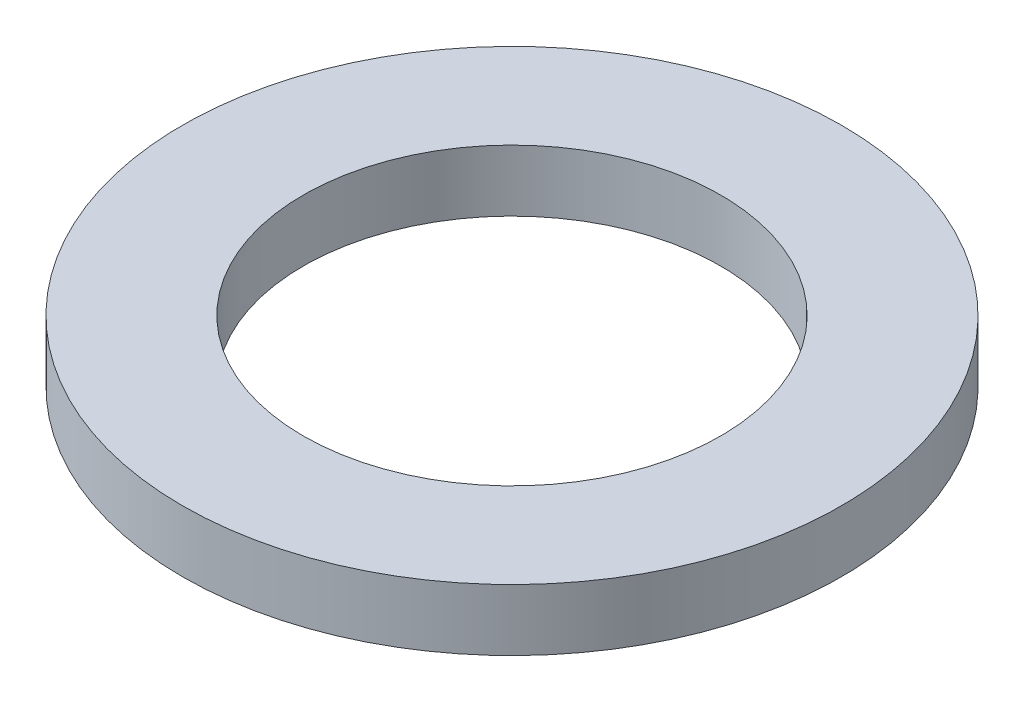
ISO-10303-21;
HEADER;
FILE_DESCRIPTION(('STEP AP214'),'2;1');
FILE_NAME('part.step','',(''),(''),'','','');
FILE_SCHEMA(('AUTOMOTIVE_DESIGN { 1 0 10303 214 1 1 1 1 }'));
ENDSEC;
DATA;
#1=APPLICATION_CONTEXT('core data for automotive mechanical design processes');
#2=APPLICATION_PROTOCOL_DEFINITION('international standard','automotive_design',2000,#1);
#3=PRODUCT_CONTEXT('',#1,'mechanical');
#4=PRODUCT('Part','Part','',(#3));
#5=PRODUCT_RELATED_PRODUCT_CATEGORY('part','',(#4));
#6=PRODUCT_DEFINITION_FORMATION('','',#4);
#7=PRODUCT_DEFINITION_CONTEXT('part definition',#1,'design');
#8=PRODUCT_DEFINITION('design','',#6,#7);
#9=PRODUCT_DEFINITION_SHAPE('','',#8);
#10=(LENGTH_UNIT() NAMED_UNIT(*) SI_UNIT(.MILLI.,.METRE.));
#11=(NAMED_UNIT(*) PLANE_ANGLE_UNIT() SI_UNIT($,.RADIAN.));
#12=(NAMED_UNIT(*) SI_UNIT($,.STERADIAN.) SOLID_ANGLE_UNIT());
#13=UNCERTAINTY_MEASURE_WITH_UNIT(LENGTH_MEASURE(1.E-05),#10,'distance_accuracy_value','');
#14=(GEOMETRIC_REPRESENTATION_CONTEXT(3) GLOBAL_UNCERTAINTY_ASSIGNED_CONTEXT((#13)) GLOBAL_UNIT_ASSIGNED_CONTEXT((#10,
#11,#12)) REPRESENTATION_CONTEXT('',''));
#15=CARTESIAN_POINT('',(0.,0.,0.));
#16=DIRECTION('',(0.,0.,1.));
#17=DIRECTION('',(1.,0.,0.));
#18=AXIS2_PLACEMENT_3D('',#15,#16,#17);
#19=CARTESIAN_POINT('',(0.,14.,0.));
#20=DIRECTION('',(0.,-1.,0.));
#21=DIRECTION('',(0.,0.,-1.));
#22=AXIS2_PLACEMENT_3D('',#19,#20,#21);
#23=CYLINDRICAL_SURFACE('',#22,75.);
#24=CARTESIAN_POINT('',(0.,14.,0.));
#25=DIRECTION('',(0.,1.,0.));
#26=DIRECTION('',(0.,0.,1.));
#27=AXIS2_PLACEMENT_3D('',#24,#25,#26);
#28=CIRCLE('',#27,75.);
#29=CARTESIAN_POINT('',(0.,14.,75.));
#30=VERTEX_POINT('',#29);
#31=EDGE_CURVE('E10',#30,#30,#28,.T.);
#32=ORIENTED_EDGE('',*,*,#31,.F.);
#33=EDGE_LOOP('',(#32));
#34=FACE_BOUND('',#33,.T.);
#35=CARTESIAN_POINT('',(0.,0.,0.));
#36=DIRECTION('',(0.,1.,0.));
#37=DIRECTION('',(0.,0.,1.));
#38=AXIS2_PLACEMENT_3D('',#35,#36,#37);
#39=CIRCLE('',#38,75.);
#40=CARTESIAN_POINT('',(0.,0.,75.));
#41=VERTEX_POINT('',#40);
#42=EDGE_CURVE('E37',#41,#41,#39,.T.);
#43=ORIENTED_EDGE('',*,*,#42,.T.);
#44=EDGE_LOOP('',(#43));
#45=FACE_BOUND('',#44,.T.);
#46=ADVANCED_FACE('F40',(#34,#45),#23,.T.);
#47=CARTESIAN_POINT('',(0.,14.,0.));
#48=DIRECTION('',(0.,1.,0.));
#49=DIRECTION('',(0.,0.,1.));
#50=AXIS2_PLACEMENT_3D('',#47,#48,#49);
#51=PLANE('',#50);
#52=CARTESIAN_POINT('',(0.,14.,0.));
#53=DIRECTION('',(0.,1.,0.));
#54=DIRECTION('',(0.,0.,1.));
#55=AXIS2_PLACEMENT_3D('',#52,#53,#54);
#56=CIRCLE('',#55,47.5);
#57=CARTESIAN_POINT('',(0.,14.,47.5));
#58=VERTEX_POINT('',#57);
#59=EDGE_CURVE('E50',#58,#58,#56,.T.);
#60=ORIENTED_EDGE('',*,*,#59,.F.);
#61=EDGE_LOOP('',(#60));
#62=FACE_BOUND('',#61,.T.);
#63=ORIENTED_EDGE('',*,*,#31,.T.);
#64=EDGE_LOOP('',(#63));
#65=FACE_BOUND('',#64,.T.);
#66=ADVANCED_FACE('F59',(#62,#65),#51,.T.);
#67=CARTESIAN_POINT('',(0.,0.,0.));
#68=DIRECTION('',(0.,1.,0.));
#69=DIRECTION('',(0.,0.,1.));
#70=AXIS2_PLACEMENT_3D('',#67,#68,#69);
#71=PLANE('',#70);
#72=CARTESIAN_POINT('',(0.,0.,0.));
#73=DIRECTION('',(0.,1.,0.));
#74=DIRECTION('',(0.,0.,1.));
#75=AXIS2_PLACEMENT_3D('',#72,#73,#74);
#76=CIRCLE('',#75,47.5);
#77=CARTESIAN_POINT('',(0.,0.,47.5));
#78=VERTEX_POINT('',#77);
#79=EDGE_CURVE('E47',#78,#78,#76,.T.);
#80=ORIENTED_EDGE('',*,*,#79,.T.);
#81=EDGE_LOOP('',(#80));
#82=FACE_BOUND('',#81,.T.);
#83=ORIENTED_EDGE('',*,*,#42,.F.);
#84=EDGE_LOOP('',(#83));
#85=FACE_BOUND('',#84,.T.);
#86=ADVANCED_FACE('F58',(#82,#85),#71,.F.);
#87=CARTESIAN_POINT('',(0.,14.,0.));
#88=DIRECTION('',(0.,-1.,0.));
#89=DIRECTION('',(0.,0.,-1.));
#90=AXIS2_PLACEMENT_3D('',#87,#88,#89);
#91=CYLINDRICAL_SURFACE('',#90,47.5);
#92=ORIENTED_EDGE('',*,*,#59,.T.);
#93=EDGE_LOOP('',(#92));
#94=FACE_BOUND('',#93,.T.);
#95=ORIENTED_EDGE('',*,*,#79,.F.);
#96=EDGE_LOOP('',(#95));
#97=FACE_BOUND('',#96,.T.);
#98=ADVANCED_FACE('F54',(#94,#97),#91,.F.);
#99=CLOSED_SHELL('',(#46,#66,#86,#98));
#100=MANIFOLD_SOLID_BREP('B2',#99);
#101=ADVANCED_BREP_SHAPE_REPRESENTATION('',(#18,#100),#14);
#102=SHAPE_DEFINITION_REPRESENTATION(#9,#101);
ENDSEC;
END-ISO-10303-21;
